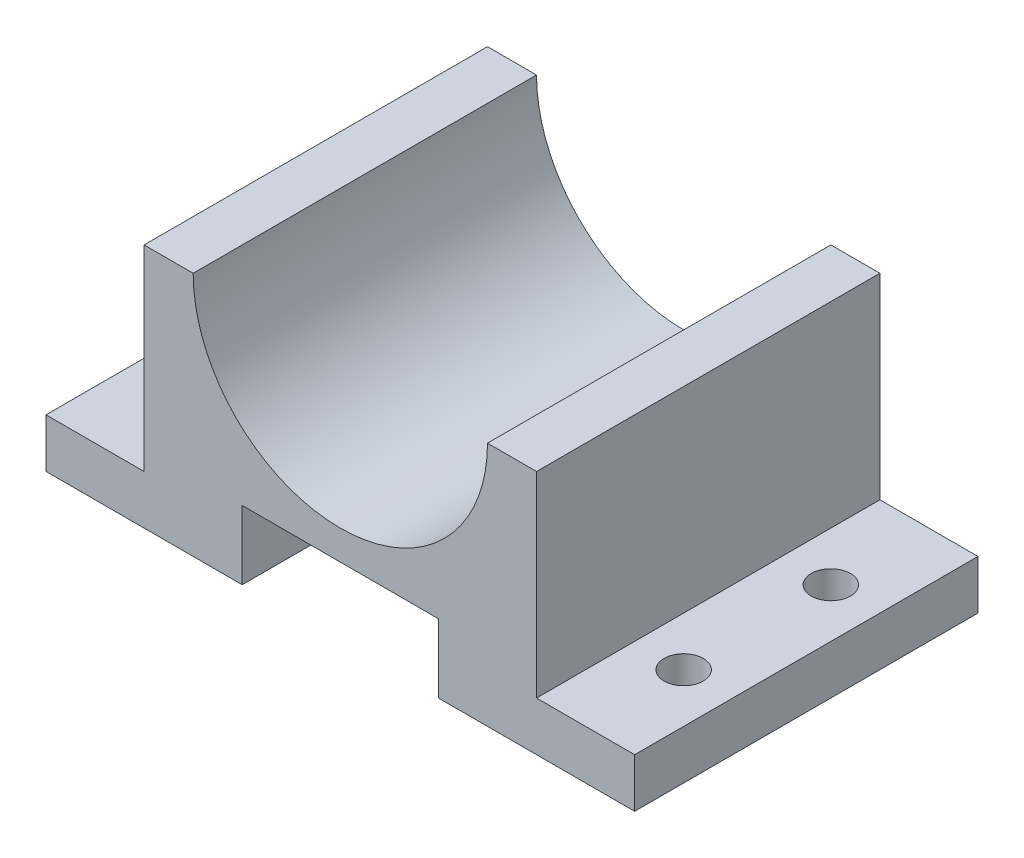
ISO-10303-21;
HEADER;
FILE_DESCRIPTION(('STEP AP214'),'2;1');
FILE_NAME('part.step','',(''),(''),'','','');
FILE_SCHEMA(('AUTOMOTIVE_DESIGN { 1 0 10303 214 1 1 1 1 }'));
ENDSEC;
DATA;
#1=APPLICATION_CONTEXT('core data for automotive mechanical design processes');
#2=APPLICATION_PROTOCOL_DEFINITION('international standard','automotive_design',2000,#1);
#3=PRODUCT_CONTEXT('',#1,'mechanical');
#4=PRODUCT('Part','Part','',(#3));
#5=PRODUCT_RELATED_PRODUCT_CATEGORY('part','',(#4));
#6=PRODUCT_DEFINITION_FORMATION('','',#4);
#7=PRODUCT_DEFINITION_CONTEXT('part definition',#1,'design');
#8=PRODUCT_DEFINITION('design','',#6,#7);
#9=PRODUCT_DEFINITION_SHAPE('','',#8);
#10=(LENGTH_UNIT() NAMED_UNIT(*) SI_UNIT(.MILLI.,.METRE.));
#11=(NAMED_UNIT(*) PLANE_ANGLE_UNIT() SI_UNIT($,.RADIAN.));
#12=(NAMED_UNIT(*) SI_UNIT($,.STERADIAN.) SOLID_ANGLE_UNIT());
#13=UNCERTAINTY_MEASURE_WITH_UNIT(LENGTH_MEASURE(1.E-05),#10,'distance_accuracy_value','');
#14=(GEOMETRIC_REPRESENTATION_CONTEXT(3) GLOBAL_UNCERTAINTY_ASSIGNED_CONTEXT((#13)) GLOBAL_UNIT_ASSIGNED_CONTEXT((#10,
#11,#12)) REPRESENTATION_CONTEXT('',''));
#15=CARTESIAN_POINT('',(0.,0.,0.));
#16=DIRECTION('',(0.,0.,1.));
#17=DIRECTION('',(1.,0.,0.));
#18=AXIS2_PLACEMENT_3D('',#15,#16,#17);
#19=CARTESIAN_POINT('',(0.,25.,35.));
#20=DIRECTION('',(0.,-1.,0.));
#21=DIRECTION('',(0.,0.,-1.));
#22=AXIS2_PLACEMENT_3D('',#19,#20,#21);
#23=PLANE('',#22);
#24=DIRECTION('',(-1.,0.,0.));
#25=VECTOR('',#24,1.);
#26=CARTESIAN_POINT('',(0.,25.,35.));
#27=LINE('',#26,#25);
#28=CARTESIAN_POINT('',(50.,25.,35.));
#29=VERTEX_POINT('',#28);
#30=CARTESIAN_POINT('',(45.,25.,35.));
#31=VERTEX_POINT('',#30);
#32=EDGE_CURVE('E247',#29,#31,#27,.T.);
#33=ORIENTED_EDGE('',*,*,#32,.F.);
#34=DIRECTION('',(0.,0.,1.));
#35=VECTOR('',#34,1.);
#36=CARTESIAN_POINT('',(50.,25.,0.));
#37=LINE('',#36,#35);
#38=CARTESIAN_POINT('',(50.,25.,0.));
#39=VERTEX_POINT('',#38);
#40=EDGE_CURVE('E167',#39,#29,#37,.T.);
#41=ORIENTED_EDGE('',*,*,#40,.F.);
#42=DIRECTION('',(-1.,0.,0.));
#43=VECTOR('',#42,1.);
#44=CARTESIAN_POINT('',(0.,25.,0.));
#45=LINE('',#44,#43);
#46=CARTESIAN_POINT('',(45.,25.,0.));
#47=VERTEX_POINT('',#46);
#48=EDGE_CURVE('E240',#39,#47,#45,.T.);
#49=ORIENTED_EDGE('',*,*,#48,.T.);
#50=DIRECTION('',(0.,0.,1.));
#51=VECTOR('',#50,1.);
#52=CARTESIAN_POINT('',(45.,25.,0.));
#53=LINE('',#52,#51);
#54=EDGE_CURVE('E72',#47,#31,#53,.T.);
#55=ORIENTED_EDGE('',*,*,#54,.T.);
#56=EDGE_LOOP('',(#33,#41,#49,#55));
#57=FACE_BOUND('',#56,.T.);
#58=ADVANCED_FACE('F57',(#57),#23,.F.);
#59=CARTESIAN_POINT('',(0.,0.,35.));
#60=DIRECTION('',(0.,0.,-1.));
#61=DIRECTION('',(-1.,0.,0.));
#62=AXIS2_PLACEMENT_3D('',#59,#60,#61);
#63=PLANE('',#62);
#64=DIRECTION('',(1.,0.,0.));
#65=VECTOR('',#64,1.);
#66=CARTESIAN_POINT('',(0.,7.,35.));
#67=LINE('',#66,#65);
#68=CARTESIAN_POINT('',(20.,7.,35.));
#69=VERTEX_POINT('',#68);
#70=CARTESIAN_POINT('',(40.,7.,35.));
#71=VERTEX_POINT('',#70);
#72=EDGE_CURVE('E168',#69,#71,#67,.T.);
#73=ORIENTED_EDGE('',*,*,#72,.T.);
#74=DIRECTION('',(0.,1.,0.));
#75=VECTOR('',#74,1.);
#76=CARTESIAN_POINT('',(40.,0.,35.));
#77=LINE('',#76,#75);
#78=CARTESIAN_POINT('',(40.,0.,35.));
#79=VERTEX_POINT('',#78);
#80=EDGE_CURVE('E201',#79,#71,#77,.T.);
#81=ORIENTED_EDGE('',*,*,#80,.F.);
#82=DIRECTION('',(1.,0.,0.));
#83=VECTOR('',#82,1.);
#84=CARTESIAN_POINT('',(0.,0.,35.));
#85=LINE('',#84,#83);
#86=CARTESIAN_POINT('',(60.,0.,35.));
#87=VERTEX_POINT('',#86);
#88=EDGE_CURVE('E239',#79,#87,#85,.T.);
#89=ORIENTED_EDGE('',*,*,#88,.T.);
#90=DIRECTION('',(0.,1.,0.));
#91=VECTOR('',#90,1.);
#92=CARTESIAN_POINT('',(60.,0.,35.));
#93=LINE('',#92,#91);
#94=CARTESIAN_POINT('',(60.,4.99999999999997,35.));
#95=VERTEX_POINT('',#94);
#96=EDGE_CURVE('E182',#87,#95,#93,.T.);
#97=ORIENTED_EDGE('',*,*,#96,.T.);
#98=DIRECTION('',(-1.,0.,0.));
#99=VECTOR('',#98,1.);
#100=CARTESIAN_POINT('',(0.,5.00000000000021,35.));
#101=LINE('',#100,#99);
#102=CARTESIAN_POINT('',(50.,5.00000000000001,35.));
#103=VERTEX_POINT('',#102);
#104=EDGE_CURVE('E161',#95,#103,#101,.T.);
#105=ORIENTED_EDGE('',*,*,#104,.T.);
#106=DIRECTION('',(0.,-1.,0.));
#107=VECTOR('',#106,1.);
#108=CARTESIAN_POINT('',(50.,0.,35.));
#109=LINE('',#108,#107);
#110=EDGE_CURVE('E171',#29,#103,#109,.T.);
#111=ORIENTED_EDGE('',*,*,#110,.F.);
#112=ORIENTED_EDGE('',*,*,#32,.T.);
#113=CARTESIAN_POINT('',(30.,25.,35.));
#114=DIRECTION('',(0.,0.,1.));
#115=DIRECTION('',(1.,0.,0.));
#116=AXIS2_PLACEMENT_3D('',#113,#114,#115);
#117=CIRCLE('',#116,15.);
#118=CARTESIAN_POINT('',(15.,25.,35.));
#119=VERTEX_POINT('',#118);
#120=EDGE_CURVE('E214',#119,#31,#117,.T.);
#121=ORIENTED_EDGE('',*,*,#120,.F.);
#122=CARTESIAN_POINT('',(10.,25.,35.));
#123=VERTEX_POINT('',#122);
#124=EDGE_CURVE('E245',#119,#123,#27,.T.);
#125=ORIENTED_EDGE('',*,*,#124,.T.);
#126=DIRECTION('',(0.,-1.,0.));
#127=VECTOR('',#126,1.);
#128=CARTESIAN_POINT('',(10.,0.,35.));
#129=LINE('',#128,#127);
#130=CARTESIAN_POINT('',(10.,5.,35.));
#131=VERTEX_POINT('',#130);
#132=EDGE_CURVE('E216',#123,#131,#129,.T.);
#133=ORIENTED_EDGE('',*,*,#132,.T.);
#134=DIRECTION('',(1.,0.,0.));
#135=VECTOR('',#134,1.);
#136=CARTESIAN_POINT('',(0.,5.,35.));
#137=LINE('',#136,#135);
#138=CARTESIAN_POINT('',(0.,5.,35.));
#139=VERTEX_POINT('',#138);
#140=EDGE_CURVE('E222',#139,#131,#137,.T.);
#141=ORIENTED_EDGE('',*,*,#140,.F.);
#142=DIRECTION('',(0.,-1.,0.));
#143=VECTOR('',#142,1.);
#144=CARTESIAN_POINT('',(0.,0.,35.));
#145=LINE('',#144,#143);
#146=CARTESIAN_POINT('',(0.,0.,35.));
#147=VERTEX_POINT('',#146);
#148=EDGE_CURVE('E237',#139,#147,#145,.T.);
#149=ORIENTED_EDGE('',*,*,#148,.T.);
#150=CARTESIAN_POINT('',(20.,0.,35.));
#151=VERTEX_POINT('',#150);
#152=EDGE_CURVE('E241',#147,#151,#85,.T.);
#153=ORIENTED_EDGE('',*,*,#152,.T.);
#154=DIRECTION('',(0.,1.,0.));
#155=VECTOR('',#154,1.);
#156=CARTESIAN_POINT('',(20.,0.,35.));
#157=LINE('',#156,#155);
#158=EDGE_CURVE('E80',#151,#69,#157,.T.);
#159=ORIENTED_EDGE('',*,*,#158,.T.);
#160=EDGE_LOOP('',(#73,#81,#89,#97,#105,#111,#112,#121,#125,#133,#141,#149,#153,#159));
#161=FACE_BOUND('',#160,.T.);
#162=ADVANCED_FACE('F180',(#161),#63,.F.);
#163=CARTESIAN_POINT('',(0.,0.,0.));
#164=DIRECTION('',(0.,0.,-1.));
#165=DIRECTION('',(-1.,0.,0.));
#166=AXIS2_PLACEMENT_3D('',#163,#164,#165);
#167=PLANE('',#166);
#168=DIRECTION('',(0.,1.,0.));
#169=VECTOR('',#168,1.);
#170=CARTESIAN_POINT('',(40.,0.,0.));
#171=LINE('',#170,#169);
#172=CARTESIAN_POINT('',(40.,0.,0.));
#173=VERTEX_POINT('',#172);
#174=CARTESIAN_POINT('',(40.,7.,0.));
#175=VERTEX_POINT('',#174);
#176=EDGE_CURVE('E193',#173,#175,#171,.T.);
#177=ORIENTED_EDGE('',*,*,#176,.T.);
#178=DIRECTION('',(1.,0.,0.));
#179=VECTOR('',#178,1.);
#180=CARTESIAN_POINT('',(0.,7.,0.));
#181=LINE('',#180,#179);
#182=CARTESIAN_POINT('',(20.,7.,0.));
#183=VERTEX_POINT('',#182);
#184=EDGE_CURVE('E204',#183,#175,#181,.T.);
#185=ORIENTED_EDGE('',*,*,#184,.F.);
#186=DIRECTION('',(0.,1.,0.));
#187=VECTOR('',#186,1.);
#188=CARTESIAN_POINT('',(20.,0.,0.));
#189=LINE('',#188,#187);
#190=CARTESIAN_POINT('',(20.,0.,0.));
#191=VERTEX_POINT('',#190);
#192=EDGE_CURVE('E209',#191,#183,#189,.T.);
#193=ORIENTED_EDGE('',*,*,#192,.F.);
#194=DIRECTION('',(1.,0.,0.));
#195=VECTOR('',#194,1.);
#196=CARTESIAN_POINT('',(0.,0.,0.));
#197=LINE('',#196,#195);
#198=CARTESIAN_POINT('',(0.,0.,0.));
#199=VERTEX_POINT('',#198);
#200=EDGE_CURVE('E250',#199,#191,#197,.T.);
#201=ORIENTED_EDGE('',*,*,#200,.F.);
#202=DIRECTION('',(0.,-1.,0.));
#203=VECTOR('',#202,1.);
#204=CARTESIAN_POINT('',(0.,0.,0.));
#205=LINE('',#204,#203);
#206=CARTESIAN_POINT('',(0.,5.,0.));
#207=VERTEX_POINT('',#206);
#208=EDGE_CURVE('E232',#207,#199,#205,.T.);
#209=ORIENTED_EDGE('',*,*,#208,.F.);
#210=DIRECTION('',(1.,0.,0.));
#211=VECTOR('',#210,1.);
#212=CARTESIAN_POINT('',(0.,5.,0.));
#213=LINE('',#212,#211);
#214=CARTESIAN_POINT('',(10.,5.,0.));
#215=VERTEX_POINT('',#214);
#216=EDGE_CURVE('E221',#207,#215,#213,.T.);
#217=ORIENTED_EDGE('',*,*,#216,.T.);
#218=DIRECTION('',(0.,-1.,0.));
#219=VECTOR('',#218,1.);
#220=CARTESIAN_POINT('',(10.,0.,0.));
#221=LINE('',#220,#219);
#222=CARTESIAN_POINT('',(10.,25.,0.));
#223=VERTEX_POINT('',#222);
#224=EDGE_CURVE('E218',#223,#215,#221,.T.);
#225=ORIENTED_EDGE('',*,*,#224,.F.);
#226=CARTESIAN_POINT('',(15.,25.,0.));
#227=VERTEX_POINT('',#226);
#228=EDGE_CURVE('E256',#227,#223,#45,.T.);
#229=ORIENTED_EDGE('',*,*,#228,.F.);
#230=CARTESIAN_POINT('',(30.,25.,0.));
#231=DIRECTION('',(0.,0.,1.));
#232=DIRECTION('',(1.,0.,0.));
#233=AXIS2_PLACEMENT_3D('',#230,#231,#232);
#234=CIRCLE('',#233,15.);
#235=EDGE_CURVE('E212',#227,#47,#234,.T.);
#236=ORIENTED_EDGE('',*,*,#235,.T.);
#237=ORIENTED_EDGE('',*,*,#48,.F.);
#238=DIRECTION('',(0.,-1.,0.));
#239=VECTOR('',#238,1.);
#240=CARTESIAN_POINT('',(50.,0.,0.));
#241=LINE('',#240,#239);
#242=CARTESIAN_POINT('',(50.,5.00000000000001,0.));
#243=VERTEX_POINT('',#242);
#244=EDGE_CURVE('E187',#39,#243,#241,.T.);
#245=ORIENTED_EDGE('',*,*,#244,.T.);
#246=DIRECTION('',(-1.,0.,0.));
#247=VECTOR('',#246,1.);
#248=CARTESIAN_POINT('',(0.,5.00000000000021,0.));
#249=LINE('',#248,#247);
#250=CARTESIAN_POINT('',(60.,4.99999999999999,0.));
#251=VERTEX_POINT('',#250);
#252=EDGE_CURVE('E164',#251,#243,#249,.T.);
#253=ORIENTED_EDGE('',*,*,#252,.F.);
#254=DIRECTION('',(0.,1.,0.));
#255=VECTOR('',#254,1.);
#256=CARTESIAN_POINT('',(60.,0.,0.));
#257=LINE('',#256,#255);
#258=CARTESIAN_POINT('',(60.,0.,0.));
#259=VERTEX_POINT('',#258);
#260=EDGE_CURVE('E253',#259,#251,#257,.T.);
#261=ORIENTED_EDGE('',*,*,#260,.F.);
#262=EDGE_CURVE('E249',#173,#259,#197,.T.);
#263=ORIENTED_EDGE('',*,*,#262,.F.);
#264=EDGE_LOOP('',(#177,#185,#193,#201,#209,#217,#225,#229,#236,#237,#245,#253,#261,#263));
#265=FACE_BOUND('',#264,.T.);
#266=ADVANCED_FACE('F267',(#265),#167,.T.);
#267=CARTESIAN_POINT('',(0.,0.,35.));
#268=DIRECTION('',(0.,1.,0.));
#269=DIRECTION('',(0.,0.,1.));
#270=AXIS2_PLACEMENT_3D('',#267,#268,#269);
#271=PLANE('',#270);
#272=CARTESIAN_POINT('',(5.,0.,10.));
#273=DIRECTION('',(0.,1.,0.));
#274=DIRECTION('',(0.,0.,-1.));
#275=AXIS2_PLACEMENT_3D('',#272,#273,#274);
#276=CIRCLE('',#275,2.);
#277=CARTESIAN_POINT('',(5.,0.,8.));
#278=VERTEX_POINT('',#277);
#279=EDGE_CURVE('E311',#278,#278,#276,.T.);
#280=ORIENTED_EDGE('',*,*,#279,.T.);
#281=EDGE_LOOP('',(#280));
#282=FACE_BOUND('',#281,.T.);
#283=CARTESIAN_POINT('',(5.,0.,25.));
#284=DIRECTION('',(0.,1.,0.));
#285=DIRECTION('',(0.,0.,1.));
#286=AXIS2_PLACEMENT_3D('',#283,#284,#285);
#287=CIRCLE('',#286,2.);
#288=CARTESIAN_POINT('',(5.,0.,27.));
#289=VERTEX_POINT('',#288);
#290=EDGE_CURVE('E200',#289,#289,#287,.T.);
#291=ORIENTED_EDGE('',*,*,#290,.T.);
#292=EDGE_LOOP('',(#291));
#293=FACE_BOUND('',#292,.T.);
#294=DIRECTION('',(0.,0.,1.));
#295=VECTOR('',#294,1.);
#296=CARTESIAN_POINT('',(20.,0.,0.));
#297=LINE('',#296,#295);
#298=EDGE_CURVE('E194',#191,#151,#297,.T.);
#299=ORIENTED_EDGE('',*,*,#298,.T.);
#300=ORIENTED_EDGE('',*,*,#152,.F.);
#301=DIRECTION('',(0.,0.,-1.));
#302=VECTOR('',#301,1.);
#303=CARTESIAN_POINT('',(0.,0.,35.));
#304=LINE('',#303,#302);
#305=EDGE_CURVE('E12',#147,#199,#304,.T.);
#306=ORIENTED_EDGE('',*,*,#305,.T.);
#307=ORIENTED_EDGE('',*,*,#200,.T.);
#308=EDGE_LOOP('',(#299,#300,#306,#307));
#309=FACE_BOUND('',#308,.T.);
#310=ADVANCED_FACE('F289',(#282,#293,#309),#271,.F.);
#311=CARTESIAN_POINT('',(60.,0.,35.));
#312=DIRECTION('',(-1.,0.,0.));
#313=DIRECTION('',(0.,0.,1.));
#314=AXIS2_PLACEMENT_3D('',#311,#312,#313);
#315=PLANE('',#314);
#316=DIRECTION('',(0.,0.,1.));
#317=VECTOR('',#316,1.);
#318=CARTESIAN_POINT('',(60.,4.99999999999999,0.));
#319=LINE('',#318,#317);
#320=EDGE_CURVE('E189',#251,#95,#319,.T.);
#321=ORIENTED_EDGE('',*,*,#320,.T.);
#322=ORIENTED_EDGE('',*,*,#96,.F.);
#323=DIRECTION('',(0.,0.,-1.));
#324=VECTOR('',#323,1.);
#325=CARTESIAN_POINT('',(60.,0.,35.));
#326=LINE('',#325,#324);
#327=EDGE_CURVE('E65',#87,#259,#326,.T.);
#328=ORIENTED_EDGE('',*,*,#327,.T.);
#329=ORIENTED_EDGE('',*,*,#260,.T.);
#330=EDGE_LOOP('',(#321,#322,#328,#329));
#331=FACE_BOUND('',#330,.T.);
#332=ADVANCED_FACE('F304',(#331),#315,.F.);
#333=ORIENTED_EDGE('',*,*,#124,.F.);
#334=DIRECTION('',(0.,0.,1.));
#335=VECTOR('',#334,1.);
#336=CARTESIAN_POINT('',(15.,25.,0.));
#337=LINE('',#336,#335);
#338=EDGE_CURVE('E183',#227,#119,#337,.T.);
#339=ORIENTED_EDGE('',*,*,#338,.F.);
#340=ORIENTED_EDGE('',*,*,#228,.T.);
#341=DIRECTION('',(0.,0.,1.));
#342=VECTOR('',#341,1.);
#343=CARTESIAN_POINT('',(10.,25.,0.));
#344=LINE('',#343,#342);
#345=EDGE_CURVE('E225',#223,#123,#344,.T.);
#346=ORIENTED_EDGE('',*,*,#345,.T.);
#347=EDGE_LOOP('',(#333,#339,#340,#346));
#348=FACE_BOUND('',#347,.T.);
#349=ADVANCED_FACE('F273',(#348),#23,.F.);
#350=CARTESIAN_POINT('',(0.,0.,35.));
#351=DIRECTION('',(1.,0.,0.));
#352=DIRECTION('',(0.,0.,-1.));
#353=AXIS2_PLACEMENT_3D('',#350,#351,#352);
#354=PLANE('',#353);
#355=ORIENTED_EDGE('',*,*,#148,.F.);
#356=DIRECTION('',(0.,0.,1.));
#357=VECTOR('',#356,1.);
#358=CARTESIAN_POINT('',(0.,5.,0.));
#359=LINE('',#358,#357);
#360=EDGE_CURVE('E233',#207,#139,#359,.T.);
#361=ORIENTED_EDGE('',*,*,#360,.F.);
#362=ORIENTED_EDGE('',*,*,#208,.T.);
#363=ORIENTED_EDGE('',*,*,#305,.F.);
#364=EDGE_LOOP('',(#355,#361,#362,#363));
#365=FACE_BOUND('',#364,.T.);
#366=ADVANCED_FACE('F59',(#365),#354,.F.);
#367=CARTESIAN_POINT('',(55.,0.,9.99999999999999));
#368=DIRECTION('',(0.,1.,0.));
#369=DIRECTION('',(0.,0.,1.));
#370=AXIS2_PLACEMENT_3D('',#367,#368,#369);
#371=CIRCLE('',#370,2.);
#372=CARTESIAN_POINT('',(55.,0.,12.));
#373=VERTEX_POINT('',#372);
#374=EDGE_CURVE('E323',#373,#373,#371,.T.);
#375=ORIENTED_EDGE('',*,*,#374,.T.);
#376=EDGE_LOOP('',(#375));
#377=FACE_BOUND('',#376,.T.);
#378=CARTESIAN_POINT('',(55.,0.,25.));
#379=DIRECTION('',(0.,1.,0.));
#380=DIRECTION('',(0.,0.,-1.));
#381=AXIS2_PLACEMENT_3D('',#378,#379,#380);
#382=CIRCLE('',#381,2.);
#383=CARTESIAN_POINT('',(55.,0.,23.));
#384=VERTEX_POINT('',#383);
#385=EDGE_CURVE('E317',#384,#384,#382,.T.);
#386=ORIENTED_EDGE('',*,*,#385,.T.);
#387=EDGE_LOOP('',(#386));
#388=FACE_BOUND('',#387,.T.);
#389=ORIENTED_EDGE('',*,*,#88,.F.);
#390=DIRECTION('',(0.,0.,1.));
#391=VECTOR('',#390,1.);
#392=CARTESIAN_POINT('',(40.,0.,0.));
#393=LINE('',#392,#391);
#394=EDGE_CURVE('E196',#173,#79,#393,.T.);
#395=ORIENTED_EDGE('',*,*,#394,.F.);
#396=ORIENTED_EDGE('',*,*,#262,.T.);
#397=ORIENTED_EDGE('',*,*,#327,.F.);
#398=EDGE_LOOP('',(#389,#395,#396,#397));
#399=FACE_BOUND('',#398,.T.);
#400=ADVANCED_FACE('F303',(#377,#388,#399),#271,.F.);
#401=CARTESIAN_POINT('',(10.,0.,0.));
#402=DIRECTION('',(-1.,0.,0.));
#403=DIRECTION('',(0.,-1.,0.));
#404=AXIS2_PLACEMENT_3D('',#401,#402,#403);
#405=PLANE('',#404);
#406=ORIENTED_EDGE('',*,*,#132,.F.);
#407=ORIENTED_EDGE('',*,*,#345,.F.);
#408=ORIENTED_EDGE('',*,*,#224,.T.);
#409=DIRECTION('',(0.,0.,1.));
#410=VECTOR('',#409,1.);
#411=CARTESIAN_POINT('',(10.,5.,0.));
#412=LINE('',#411,#410);
#413=EDGE_CURVE('E230',#215,#131,#412,.T.);
#414=ORIENTED_EDGE('',*,*,#413,.T.);
#415=EDGE_LOOP('',(#406,#407,#408,#414));
#416=FACE_BOUND('',#415,.T.);
#417=ADVANCED_FACE('F278',(#416),#405,.T.);
#418=CARTESIAN_POINT('',(0.,5.,0.));
#419=DIRECTION('',(0.,-1.,0.));
#420=DIRECTION('',(0.,0.,-1.));
#421=AXIS2_PLACEMENT_3D('',#418,#419,#420);
#422=PLANE('',#421);
#423=CARTESIAN_POINT('',(5.,5.,10.));
#424=DIRECTION('',(0.,1.,0.));
#425=DIRECTION('',(0.,0.,-1.));
#426=AXIS2_PLACEMENT_3D('',#423,#424,#425);
#427=CIRCLE('',#426,2.);
#428=CARTESIAN_POINT('',(5.,5.,8.));
#429=VERTEX_POINT('',#428);
#430=EDGE_CURVE('E326',#429,#429,#427,.T.);
#431=ORIENTED_EDGE('',*,*,#430,.F.);
#432=EDGE_LOOP('',(#431));
#433=FACE_BOUND('',#432,.T.);
#434=CARTESIAN_POINT('',(5.,5.,25.));
#435=DIRECTION('',(0.,1.,0.));
#436=DIRECTION('',(0.,0.,1.));
#437=AXIS2_PLACEMENT_3D('',#434,#435,#436);
#438=CIRCLE('',#437,2.);
#439=CARTESIAN_POINT('',(5.,5.,27.));
#440=VERTEX_POINT('',#439);
#441=EDGE_CURVE('E308',#440,#440,#438,.T.);
#442=ORIENTED_EDGE('',*,*,#441,.F.);
#443=EDGE_LOOP('',(#442));
#444=FACE_BOUND('',#443,.T.);
#445=ORIENTED_EDGE('',*,*,#140,.T.);
#446=ORIENTED_EDGE('',*,*,#413,.F.);
#447=ORIENTED_EDGE('',*,*,#216,.F.);
#448=ORIENTED_EDGE('',*,*,#360,.T.);
#449=EDGE_LOOP('',(#445,#446,#447,#448));
#450=FACE_BOUND('',#449,.T.);
#451=ADVANCED_FACE('F280',(#433,#444,#450),#422,.F.);
#452=CARTESIAN_POINT('',(0.,5.00000000000021,0.));
#453=DIRECTION('',(0.,1.,0.));
#454=DIRECTION('',(-1.,0.,0.));
#455=AXIS2_PLACEMENT_3D('',#452,#453,#454);
#456=PLANE('',#455);
#457=CARTESIAN_POINT('',(55.,5.,9.99999999999999));
#458=DIRECTION('',(0.,1.,0.));
#459=DIRECTION('',(0.,0.,1.));
#460=AXIS2_PLACEMENT_3D('',#457,#458,#459);
#461=CIRCLE('',#460,2.);
#462=CARTESIAN_POINT('',(55.,5.,12.));
#463=VERTEX_POINT('',#462);
#464=EDGE_CURVE('E320',#463,#463,#461,.T.);
#465=ORIENTED_EDGE('',*,*,#464,.F.);
#466=EDGE_LOOP('',(#465));
#467=FACE_BOUND('',#466,.T.);
#468=CARTESIAN_POINT('',(55.,5.,25.));
#469=DIRECTION('',(0.,1.,0.));
#470=DIRECTION('',(0.,0.,-1.));
#471=AXIS2_PLACEMENT_3D('',#468,#469,#470);
#472=CIRCLE('',#471,2.);
#473=CARTESIAN_POINT('',(55.,5.,23.));
#474=VERTEX_POINT('',#473);
#475=EDGE_CURVE('E314',#474,#474,#472,.T.);
#476=ORIENTED_EDGE('',*,*,#475,.F.);
#477=EDGE_LOOP('',(#476));
#478=FACE_BOUND('',#477,.T.);
#479=ORIENTED_EDGE('',*,*,#104,.F.);
#480=ORIENTED_EDGE('',*,*,#320,.F.);
#481=ORIENTED_EDGE('',*,*,#252,.T.);
#482=DIRECTION('',(0.,0.,1.));
#483=VECTOR('',#482,1.);
#484=CARTESIAN_POINT('',(50.,5.00000000000001,0.));
#485=LINE('',#484,#483);
#486=EDGE_CURVE('E157',#243,#103,#485,.T.);
#487=ORIENTED_EDGE('',*,*,#486,.T.);
#488=EDGE_LOOP('',(#479,#480,#481,#487));
#489=FACE_BOUND('',#488,.T.);
#490=ADVANCED_FACE('F159',(#467,#478,#489),#456,.T.);
#491=CARTESIAN_POINT('',(50.,0.,0.));
#492=DIRECTION('',(-1.,0.,0.));
#493=DIRECTION('',(0.,0.,1.));
#494=AXIS2_PLACEMENT_3D('',#491,#492,#493);
#495=PLANE('',#494);
#496=ORIENTED_EDGE('',*,*,#110,.T.);
#497=ORIENTED_EDGE('',*,*,#486,.F.);
#498=ORIENTED_EDGE('',*,*,#244,.F.);
#499=ORIENTED_EDGE('',*,*,#40,.T.);
#500=EDGE_LOOP('',(#496,#497,#498,#499));
#501=FACE_BOUND('',#500,.T.);
#502=ADVANCED_FACE('F172',(#501),#495,.F.);
#503=CARTESIAN_POINT('',(0.,7.,0.));
#504=DIRECTION('',(0.,-1.,0.));
#505=DIRECTION('',(0.,0.,-1.));
#506=AXIS2_PLACEMENT_3D('',#503,#504,#505);
#507=PLANE('',#506);
#508=ORIENTED_EDGE('',*,*,#72,.F.);
#509=DIRECTION('',(0.,0.,1.));
#510=VECTOR('',#509,1.);
#511=CARTESIAN_POINT('',(20.,7.,0.));
#512=LINE('',#511,#510);
#513=EDGE_CURVE('E191',#183,#69,#512,.T.);
#514=ORIENTED_EDGE('',*,*,#513,.F.);
#515=ORIENTED_EDGE('',*,*,#184,.T.);
#516=DIRECTION('',(0.,0.,1.));
#517=VECTOR('',#516,1.);
#518=CARTESIAN_POINT('',(40.,7.,0.));
#519=LINE('',#518,#517);
#520=EDGE_CURVE('E198',#175,#71,#519,.T.);
#521=ORIENTED_EDGE('',*,*,#520,.T.);
#522=EDGE_LOOP('',(#508,#514,#515,#521));
#523=FACE_BOUND('',#522,.T.);
#524=ADVANCED_FACE('F295',(#523),#507,.T.);
#525=CARTESIAN_POINT('',(40.,0.,0.));
#526=DIRECTION('',(1.,0.,0.));
#527=DIRECTION('',(0.,0.,-1.));
#528=AXIS2_PLACEMENT_3D('',#525,#526,#527);
#529=PLANE('',#528);
#530=ORIENTED_EDGE('',*,*,#80,.T.);
#531=ORIENTED_EDGE('',*,*,#520,.F.);
#532=ORIENTED_EDGE('',*,*,#176,.F.);
#533=ORIENTED_EDGE('',*,*,#394,.T.);
#534=EDGE_LOOP('',(#530,#531,#532,#533));
#535=FACE_BOUND('',#534,.T.);
#536=ADVANCED_FACE('F299',(#535),#529,.F.);
#537=CARTESIAN_POINT('',(20.,0.,0.));
#538=DIRECTION('',(1.,0.,0.));
#539=DIRECTION('',(0.,0.,-1.));
#540=AXIS2_PLACEMENT_3D('',#537,#538,#539);
#541=PLANE('',#540);
#542=ORIENTED_EDGE('',*,*,#158,.F.);
#543=ORIENTED_EDGE('',*,*,#298,.F.);
#544=ORIENTED_EDGE('',*,*,#192,.T.);
#545=ORIENTED_EDGE('',*,*,#513,.T.);
#546=EDGE_LOOP('',(#542,#543,#544,#545));
#547=FACE_BOUND('',#546,.T.);
#548=ADVANCED_FACE('F357',(#547),#541,.T.);
#549=CARTESIAN_POINT('',(30.,25.,0.));
#550=DIRECTION('',(0.,0.,1.));
#551=DIRECTION('',(1.,0.,0.));
#552=AXIS2_PLACEMENT_3D('',#549,#550,#551);
#553=CYLINDRICAL_SURFACE('',#552,15.);
#554=ORIENTED_EDGE('',*,*,#120,.T.);
#555=ORIENTED_EDGE('',*,*,#54,.F.);
#556=ORIENTED_EDGE('',*,*,#235,.F.);
#557=ORIENTED_EDGE('',*,*,#338,.T.);
#558=EDGE_LOOP('',(#554,#555,#556,#557));
#559=FACE_BOUND('',#558,.T.);
#560=ADVANCED_FACE('F271',(#559),#553,.F.);
#561=CARTESIAN_POINT('',(5.,0.,25.));
#562=DIRECTION('',(0.,1.,0.));
#563=DIRECTION('',(0.,0.,1.));
#564=AXIS2_PLACEMENT_3D('',#561,#562,#563);
#565=CYLINDRICAL_SURFACE('',#564,2.);
#566=ORIENTED_EDGE('',*,*,#290,.F.);
#567=EDGE_LOOP('',(#566));
#568=FACE_BOUND('',#567,.T.);
#569=ORIENTED_EDGE('',*,*,#441,.T.);
#570=EDGE_LOOP('',(#569));
#571=FACE_BOUND('',#570,.T.);
#572=ADVANCED_FACE('F346',(#568,#571),#565,.F.);
#573=CARTESIAN_POINT('',(55.,0.,25.));
#574=DIRECTION('',(0.,1.,0.));
#575=DIRECTION('',(0.,0.,1.));
#576=AXIS2_PLACEMENT_3D('',#573,#574,#575);
#577=CYLINDRICAL_SURFACE('',#576,2.);
#578=ORIENTED_EDGE('',*,*,#385,.F.);
#579=EDGE_LOOP('',(#578));
#580=FACE_BOUND('',#579,.T.);
#581=ORIENTED_EDGE('',*,*,#475,.T.);
#582=EDGE_LOOP('',(#581));
#583=FACE_BOUND('',#582,.T.);
#584=ADVANCED_FACE('F348',(#580,#583),#577,.F.);
#585=CARTESIAN_POINT('',(55.,0.,9.99999999999999));
#586=DIRECTION('',(0.,1.,0.));
#587=DIRECTION('',(0.,0.,1.));
#588=AXIS2_PLACEMENT_3D('',#585,#586,#587);
#589=CYLINDRICAL_SURFACE('',#588,2.);
#590=ORIENTED_EDGE('',*,*,#374,.F.);
#591=EDGE_LOOP('',(#590));
#592=FACE_BOUND('',#591,.T.);
#593=ORIENTED_EDGE('',*,*,#464,.T.);
#594=EDGE_LOOP('',(#593));
#595=FACE_BOUND('',#594,.T.);
#596=ADVANCED_FACE('F337',(#592,#595),#589,.F.);
#597=CARTESIAN_POINT('',(5.,0.,10.));
#598=DIRECTION('',(0.,1.,0.));
#599=DIRECTION('',(0.,0.,1.));
#600=AXIS2_PLACEMENT_3D('',#597,#598,#599);
#601=CYLINDRICAL_SURFACE('',#600,2.);
#602=ORIENTED_EDGE('',*,*,#279,.F.);
#603=EDGE_LOOP('',(#602));
#604=FACE_BOUND('',#603,.T.);
#605=ORIENTED_EDGE('',*,*,#430,.T.);
#606=EDGE_LOOP('',(#605));
#607=FACE_BOUND('',#606,.T.);
#608=ADVANCED_FACE('F334',(#604,#607),#601,.F.);
#609=CLOSED_SHELL('',(#58,#162,#266,#310,#332,#349,#366,#400,#417,#451,#490,#502,#524,#536,#548,
#560,#572,#584,#596,#608));
#610=MANIFOLD_SOLID_BREP('B2',#609);
#611=ADVANCED_BREP_SHAPE_REPRESENTATION('',(#18,#610),#14);
#612=SHAPE_DEFINITION_REPRESENTATION(#9,#611);
ENDSEC;
END-ISO-10303-21;
